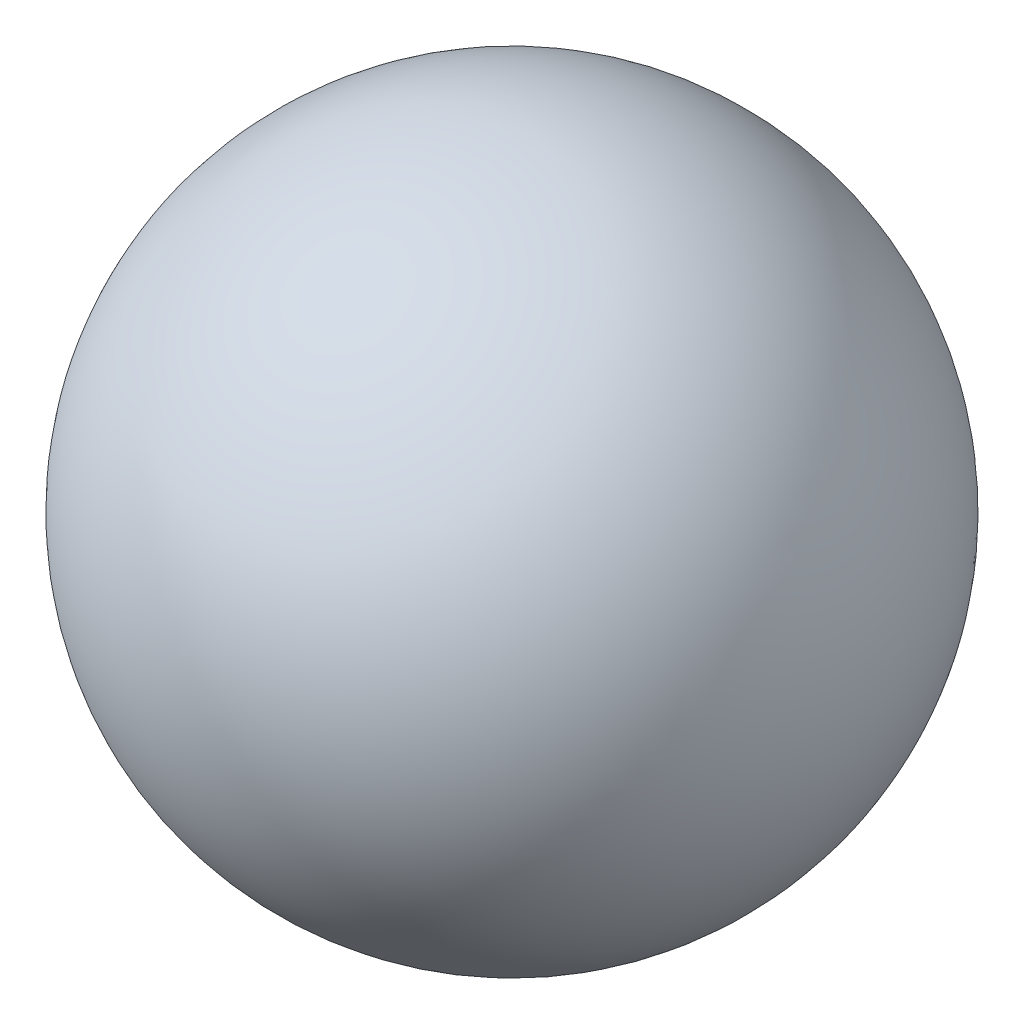
ISO-10303-21;
HEADER;
FILE_DESCRIPTION(('STEP AP214'),'2;1');
FILE_NAME('part.step','',(''),(''),'','','');
FILE_SCHEMA(('AUTOMOTIVE_DESIGN { 1 0 10303 214 1 1 1 1 }'));
ENDSEC;
DATA;
#1=APPLICATION_CONTEXT('core data for automotive mechanical design processes');
#2=APPLICATION_PROTOCOL_DEFINITION('international standard','automotive_design',2000,#1);
#3=PRODUCT_CONTEXT('',#1,'mechanical');
#4=PRODUCT('Part','Part','',(#3));
#5=PRODUCT_RELATED_PRODUCT_CATEGORY('part','',(#4));
#6=PRODUCT_DEFINITION_FORMATION('','',#4);
#7=PRODUCT_DEFINITION_CONTEXT('part definition',#1,'design');
#8=PRODUCT_DEFINITION('design','',#6,#7);
#9=PRODUCT_DEFINITION_SHAPE('','',#8);
#10=(LENGTH_UNIT() NAMED_UNIT(*) SI_UNIT(.MILLI.,.METRE.));
#11=(NAMED_UNIT(*) PLANE_ANGLE_UNIT() SI_UNIT($,.RADIAN.));
#12=(NAMED_UNIT(*) SI_UNIT($,.STERADIAN.) SOLID_ANGLE_UNIT());
#13=UNCERTAINTY_MEASURE_WITH_UNIT(LENGTH_MEASURE(1.E-05),#10,'distance_accuracy_value','');
#14=(GEOMETRIC_REPRESENTATION_CONTEXT(3) GLOBAL_UNCERTAINTY_ASSIGNED_CONTEXT((#13)) GLOBAL_UNIT_ASSIGNED_CONTEXT((#10,
#11,#12)) REPRESENTATION_CONTEXT('',''));
#15=CARTESIAN_POINT('',(0.,0.,0.));
#16=DIRECTION('',(0.,0.,1.));
#17=DIRECTION('',(1.,0.,0.));
#18=AXIS2_PLACEMENT_3D('',#15,#16,#17);
#19=CARTESIAN_POINT('',(0.,0.,0.));
#20=DIRECTION('',(1.,0.,0.));
#21=DIRECTION('',(0.,0.,-1.));
#22=AXIS2_PLACEMENT_3D('',#19,#20,#21);
#23=SPHERICAL_SURFACE('',#22,127.);
#24=CARTESIAN_POINT('',(-127.,0.,0.));
#25=VERTEX_POINT('',#24);
#26=VERTEX_LOOP('',#25);
#27=FACE_BOUND('',#26,.T.);
#28=CARTESIAN_POINT('',(127.,0.,0.));
#29=VERTEX_POINT('',#28);
#30=VERTEX_LOOP('',#29);
#31=FACE_BOUND('',#30,.T.);
#32=ADVANCED_FACE('F16',(#27,#31),#23,.T.);
#33=CLOSED_SHELL('',(#32));
#34=MANIFOLD_SOLID_BREP('B1',#33);
#35=ADVANCED_BREP_SHAPE_REPRESENTATION('',(#18,#34),#14);
#36=SHAPE_DEFINITION_REPRESENTATION(#9,#35);
ENDSEC;
END-ISO-10303-21;
